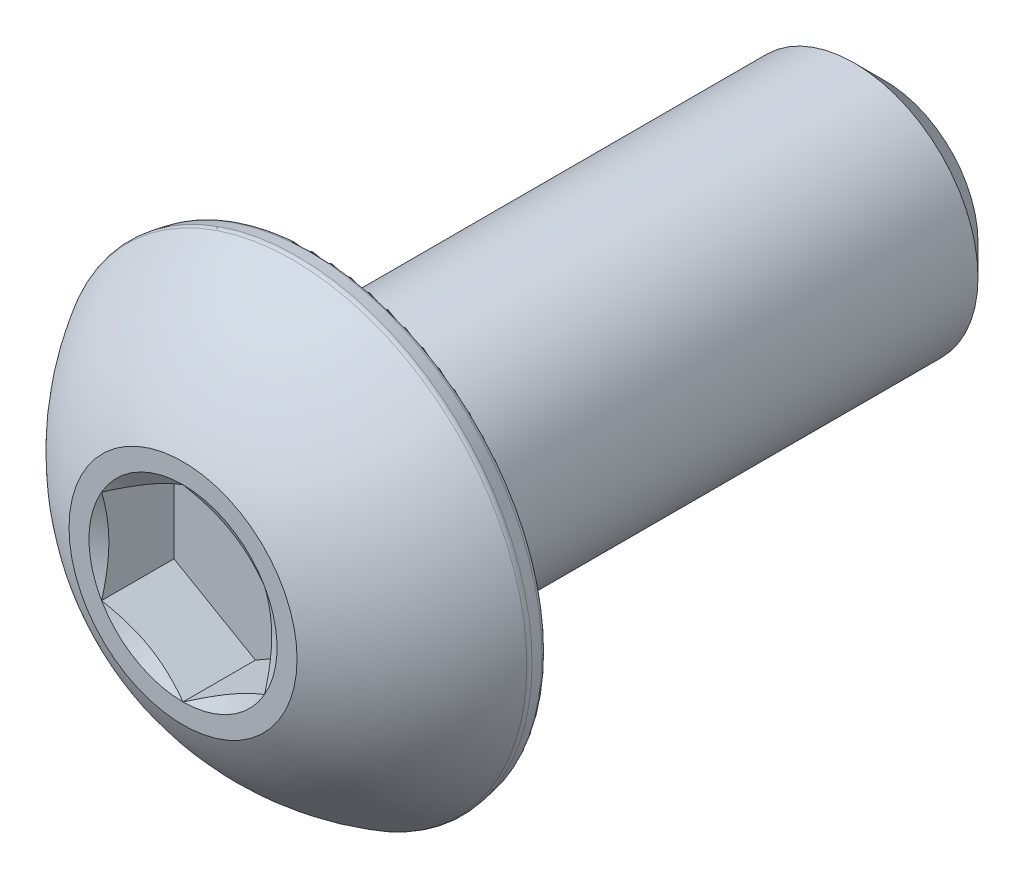
ISO-10303-21;
HEADER;
FILE_DESCRIPTION(('STEP AP214'),'2;1');
FILE_NAME('part.step','',(''),(''),'','','');
FILE_SCHEMA(('AUTOMOTIVE_DESIGN { 1 0 10303 214 1 1 1 1 }'));
ENDSEC;
DATA;
#1=APPLICATION_CONTEXT('core data for automotive mechanical design processes');
#2=APPLICATION_PROTOCOL_DEFINITION('international standard','automotive_design',2000,#1);
#3=PRODUCT_CONTEXT('',#1,'mechanical');
#4=PRODUCT('Part','Part','',(#3));
#5=PRODUCT_RELATED_PRODUCT_CATEGORY('part','',(#4));
#6=PRODUCT_DEFINITION_FORMATION('','',#4);
#7=PRODUCT_DEFINITION_CONTEXT('part definition',#1,'design');
#8=PRODUCT_DEFINITION('design','',#6,#7);
#9=PRODUCT_DEFINITION_SHAPE('','',#8);
#10=(LENGTH_UNIT() NAMED_UNIT(*) SI_UNIT(.MILLI.,.METRE.));
#11=(NAMED_UNIT(*) PLANE_ANGLE_UNIT() SI_UNIT($,.RADIAN.));
#12=(NAMED_UNIT(*) SI_UNIT($,.STERADIAN.) SOLID_ANGLE_UNIT());
#13=UNCERTAINTY_MEASURE_WITH_UNIT(LENGTH_MEASURE(1.E-05),#10,'distance_accuracy_value','');
#14=(GEOMETRIC_REPRESENTATION_CONTEXT(3) GLOBAL_UNCERTAINTY_ASSIGNED_CONTEXT((#13)) GLOBAL_UNIT_ASSIGNED_CONTEXT((#10,
#11,#12)) REPRESENTATION_CONTEXT('',''));
#15=CARTESIAN_POINT('',(0.,0.,0.));
#16=DIRECTION('',(0.,0.,1.));
#17=DIRECTION('',(1.,0.,0.));
#18=AXIS2_PLACEMENT_3D('',#15,#16,#17);
#19=CARTESIAN_POINT('',(0.,0.,6.83895));
#20=DIRECTION('',(0.,0.,-1.));
#21=DIRECTION('',(-1.,0.,0.));
#22=AXIS2_PLACEMENT_3D('',#19,#20,#21);
#23=PLANE('',#22);
#24=CARTESIAN_POINT('',(0.,0.,6.83895));
#25=DIRECTION('',(0.,0.,1.));
#26=DIRECTION('',(1.,0.,0.));
#27=AXIS2_PLACEMENT_3D('',#24,#25,#26);
#28=CIRCLE('',#27,1.83308710467706);
#29=CARTESIAN_POINT('',(-1.5875,0.916543552338531,6.83895));
#30=VERTEX_POINT('',#29);
#31=CARTESIAN_POINT('',(-1.5875,-0.916543552338531,6.83895));
#32=VERTEX_POINT('',#31);
#33=EDGE_CURVE('E95',#30,#32,#28,.T.);
#34=ORIENTED_EDGE('',*,*,#33,.F.);
#35=CARTESIAN_POINT('',(0.,1.83308710467706,6.83895));
#36=VERTEX_POINT('',#35);
#37=EDGE_CURVE('E104',#36,#30,#28,.T.);
#38=ORIENTED_EDGE('',*,*,#37,.F.);
#39=CARTESIAN_POINT('',(1.5875,0.916543552338532,6.83895));
#40=VERTEX_POINT('',#39);
#41=EDGE_CURVE('E55',#40,#36,#28,.T.);
#42=ORIENTED_EDGE('',*,*,#41,.F.);
#43=CARTESIAN_POINT('',(1.5875,-0.91654355233853,6.83895));
#44=VERTEX_POINT('',#43);
#45=EDGE_CURVE('E62',#44,#40,#28,.T.);
#46=ORIENTED_EDGE('',*,*,#45,.F.);
#47=CARTESIAN_POINT('',(0.,-1.83308710467706,6.83895));
#48=VERTEX_POINT('',#47);
#49=EDGE_CURVE('E137',#48,#44,#28,.T.);
#50=ORIENTED_EDGE('',*,*,#49,.F.);
#51=EDGE_CURVE('E105',#32,#48,#28,.T.);
#52=ORIENTED_EDGE('',*,*,#51,.F.);
#53=EDGE_LOOP('',(#34,#38,#42,#46,#50,#52));
#54=FACE_BOUND('',#53,.T.);
#55=CARTESIAN_POINT('',(0.,0.,6.83895));
#56=DIRECTION('',(0.,0.,1.));
#57=DIRECTION('',(1.,0.,0.));
#58=AXIS2_PLACEMENT_3D('',#55,#56,#57);
#59=CIRCLE('',#58,2.2225);
#60=CARTESIAN_POINT('',(2.2225,0.,6.83895));
#61=VERTEX_POINT('',#60);
#62=EDGE_CURVE('E116',#61,#61,#59,.T.);
#63=ORIENTED_EDGE('',*,*,#62,.T.);
#64=EDGE_LOOP('',(#63));
#65=FACE_BOUND('',#64,.T.);
#66=ADVANCED_FACE('F41',(#54,#65),#23,.F.);
#67=CARTESIAN_POINT('',(0.,0.,2.06158685789167));
#68=DIRECTION('',(0.,0.,1.));
#69=DIRECTION('',(0.,1.,0.));
#70=AXIS2_PLACEMENT_3D('',#67,#68,#69);
#71=SPHERICAL_SURFACE('',#70,5.26903262863072);
#72=CARTESIAN_POINT('',(0.,0.,4.69913865455147));
#73=DIRECTION('',(0.,0.,-1.));
#74=DIRECTION('',(-1.,0.,0.));
#75=AXIS2_PLACEMENT_3D('',#72,#73,#74);
#76=CIRCLE('',#75,4.56136222651872);
#77=CARTESIAN_POINT('',(-4.56136222651872,0.,4.69913865455147));
#78=VERTEX_POINT('',#77);
#79=EDGE_CURVE('E115',#78,#78,#76,.F.);
#80=ORIENTED_EDGE('',*,*,#79,.T.);
#81=EDGE_LOOP('',(#80));
#82=FACE_BOUND('',#81,.T.);
#83=ORIENTED_EDGE('',*,*,#62,.F.);
#84=EDGE_LOOP('',(#83));
#85=FACE_BOUND('',#84,.T.);
#86=ADVANCED_FACE('F210',(#82,#85),#71,.T.);
#87=CARTESIAN_POINT('',(0.,0.,4.27355));
#88=DIRECTION('',(0.,0.,1.));
#89=DIRECTION('',(1.,0.,0.));
#90=AXIS2_PLACEMENT_3D('',#87,#88,#89);
#91=CONICAL_SURFACE('',#90,4.51684761455358,0.174532925199434);
#92=CARTESIAN_POINT('',(0.,0.,4.61265590663413));
#93=DIRECTION('',(0.,0.,-1.));
#94=DIRECTION('',(-1.,0.,0.));
#95=AXIS2_PLACEMENT_3D('',#92,#93,#94);
#96=CIRCLE('',#95,4.57664113521078);
#97=CARTESIAN_POINT('',(-4.57664113521078,0.,4.61265590663413));
#98=VERTEX_POINT('',#97);
#99=EDGE_CURVE('E49',#98,#98,#96,.T.);
#100=ORIENTED_EDGE('',*,*,#99,.T.);
#101=EDGE_LOOP('',(#100));
#102=FACE_BOUND('',#101,.T.);
#103=CARTESIAN_POINT('',(0.,0.,4.37954614825066));
#104=DIRECTION('',(0.,0.,-1.));
#105=DIRECTION('',(-1.,0.,0.));
#106=AXIS2_PLACEMENT_3D('',#103,#104,#105);
#107=CIRCLE('',#106,4.53553759534134);
#108=CARTESIAN_POINT('',(-4.53553759534134,0.,4.37954614825066));
#109=VERTEX_POINT('',#108);
#110=EDGE_CURVE('E235',#109,#109,#107,.F.);
#111=ORIENTED_EDGE('',*,*,#110,.T.);
#112=EDGE_LOOP('',(#111));
#113=FACE_BOUND('',#112,.T.);
#114=ADVANCED_FACE('F217',(#102,#113),#91,.T.);
#115=CARTESIAN_POINT('',(0.,4.51684761455358,4.27355));
#116=DIRECTION('',(0.,0.,1.));
#117=DIRECTION('',(1.,0.,0.));
#118=AXIS2_PLACEMENT_3D('',#115,#116,#117);
#119=PLANE('',#118);
#120=CARTESIAN_POINT('',(0.,0.,4.27355));
#121=DIRECTION('',(0.,0.,1.));
#122=DIRECTION('',(1.,0.,0.));
#123=AXIS2_PLACEMENT_3D('',#120,#121,#122);
#124=CIRCLE('',#123,4.40921630486247);
#125=CARTESIAN_POINT('',(4.40921630486247,0.,4.27355));
#126=VERTEX_POINT('',#125);
#127=EDGE_CURVE('E11',#126,#126,#124,.F.);
#128=ORIENTED_EDGE('',*,*,#127,.T.);
#129=EDGE_LOOP('',(#128));
#130=FACE_BOUND('',#129,.T.);
#131=CARTESIAN_POINT('',(0.,0.,4.27355));
#132=DIRECTION('',(0.,0.,1.));
#133=DIRECTION('',(1.,0.,0.));
#134=AXIS2_PLACEMENT_3D('',#131,#132,#133);
#135=CIRCLE('',#134,2.413);
#136=CARTESIAN_POINT('',(2.413,0.,4.27355));
#137=VERTEX_POINT('',#136);
#138=EDGE_CURVE('E298',#137,#137,#135,.T.);
#139=ORIENTED_EDGE('',*,*,#138,.T.);
#140=EDGE_LOOP('',(#139));
#141=FACE_BOUND('',#140,.T.);
#142=ADVANCED_FACE('F241',(#130,#141),#119,.F.);
#143=CARTESIAN_POINT('',(0.,0.,6.83895));
#144=DIRECTION('',(0.,0.,1.));
#145=DIRECTION('',(1.,0.,0.));
#146=AXIS2_PLACEMENT_3D('',#143,#144,#145);
#147=CYLINDRICAL_SURFACE('',#146,2.413);
#148=ORIENTED_EDGE('',*,*,#138,.F.);
#149=EDGE_LOOP('',(#148));
#150=FACE_BOUND('',#149,.T.);
#151=CARTESIAN_POINT('',(0.,0.,-6.24363749999999));
#152=DIRECTION('',(0.,0.,1.));
#153=DIRECTION('',(1.,0.,0.));
#154=AXIS2_PLACEMENT_3D('',#151,#152,#153);
#155=CIRCLE('',#154,2.413);
#156=CARTESIAN_POINT('',(2.413,0.,-6.24363749999999));
#157=VERTEX_POINT('',#156);
#158=EDGE_CURVE('E295',#157,#157,#155,.T.);
#159=ORIENTED_EDGE('',*,*,#158,.T.);
#160=EDGE_LOOP('',(#159));
#161=FACE_BOUND('',#160,.T.);
#162=ADVANCED_FACE('F246',(#150,#161),#147,.T.);
#163=CARTESIAN_POINT('',(0.,0.,-6.83895));
#164=DIRECTION('',(0.,0.,1.));
#165=DIRECTION('',(1.,0.,0.));
#166=AXIS2_PLACEMENT_3D('',#163,#164,#165);
#167=CONICAL_SURFACE('',#166,1.8176875,0.785398163397444);
#168=ORIENTED_EDGE('',*,*,#158,.F.);
#169=EDGE_LOOP('',(#168));
#170=FACE_BOUND('',#169,.T.);
#171=CARTESIAN_POINT('',(0.,0.,-6.83895));
#172=DIRECTION('',(0.,0.,1.));
#173=DIRECTION('',(1.,0.,0.));
#174=AXIS2_PLACEMENT_3D('',#171,#172,#173);
#175=CIRCLE('',#174,1.8176875);
#176=CARTESIAN_POINT('',(1.8176875,0.,-6.83895));
#177=VERTEX_POINT('',#176);
#178=EDGE_CURVE('E283',#177,#177,#175,.T.);
#179=ORIENTED_EDGE('',*,*,#178,.T.);
#180=EDGE_LOOP('',(#179));
#181=FACE_BOUND('',#180,.T.);
#182=ADVANCED_FACE('F252',(#170,#181),#167,.T.);
#183=CARTESIAN_POINT('',(0.,0.,-6.83895));
#184=DIRECTION('',(0.,0.,1.));
#185=DIRECTION('',(1.,0.,0.));
#186=AXIS2_PLACEMENT_3D('',#183,#184,#185);
#187=PLANE('',#186);
#188=ORIENTED_EDGE('',*,*,#178,.F.);
#189=EDGE_LOOP('',(#188));
#190=FACE_BOUND('',#189,.T.);
#191=ADVANCED_FACE('F256',(#190),#187,.F.);
#192=CARTESIAN_POINT('',(0.,0.,6.83895));
#193=DIRECTION('',(0.,0.,1.));
#194=DIRECTION('',(1.,0.,0.));
#195=AXIS2_PLACEMENT_3D('',#192,#193,#194);
#196=CONICAL_SURFACE('',#195,1.83308710467706,1.0471975511966);
#197=ORIENTED_EDGE('',*,*,#51,.T.);
#198=CARTESIAN_POINT('',(-1.5877,-0.916428082284693,6.83901667296548));
#199=CARTESIAN_POINT('',(-1.51793561383713,-0.956706569415676,6.8157507862806));
#200=CARTESIAN_POINT('',(-1.44756902994941,-0.997332735565202,6.79459084371131));
#201=CARTESIAN_POINT('',(-1.30561723674211,-1.07928864158539,6.75765488003136));
#202=CARTESIAN_POINT('',(-1.23402950399672,-1.12061983835662,6.74189192735861));
#203=CARTESIAN_POINT('',(-1.09174129077364,-1.20276997656347,6.7173531289101));
#204=CARTESIAN_POINT('',(-1.02106271077293,-1.24357627375282,6.70841398931757));
#205=CARTESIAN_POINT('',(-0.87937276149872,-1.32538100410775,6.69773997802977));
#206=CARTESIAN_POINT('',(-0.808361907681014,-1.36637913967479,6.6959962700179));
#207=CARTESIAN_POINT('',(-0.675659384402059,-1.44299497721204,6.69961202281142));
#208=CARTESIAN_POINT('',(-0.6139479110751,-1.47862411294944,6.70408369010886));
#209=CARTESIAN_POINT('',(-0.49092703935686,-1.54965024635191,6.71825990710371));
#210=CARTESIAN_POINT('',(-0.429618066887652,-1.58504699811075,6.72796930554132));
#211=CARTESIAN_POINT('',(-0.306343280023913,-1.65621972949082,6.7522434889126));
#212=CARTESIAN_POINT('',(-0.244393078468155,-1.69198669503539,6.76691123370721));
#213=CARTESIAN_POINT('',(-0.121416971719016,-1.7629869833709,6.80020179834348));
#214=CARTESIAN_POINT('',(-0.0603894894127829,-1.79822121670837,6.81881678939009));
#215=CARTESIAN_POINT('',(0.000200000000000363,-1.8332025747309,6.83901667296548));
#216=B_SPLINE_CURVE_WITH_KNOTS('',3,(#198,#199,#200,#201,#202,#203,#204,#205,#206,#207,#208,
#209,#210,#211,#212,#213,#214,#215),.UNSPECIFIED.,.F.,.F.,(4,2,2,2,2,2,2,2,4),(0.,
0.251647272601204,0.503899652171032,0.749908024753695,0.995614197816256,1.20960574360963,
1.42379572923035,1.64273857632785,1.86125117688),.UNSPECIFIED.);
#217=EDGE_CURVE('E110',#32,#48,#216,.T.);
#218=ORIENTED_EDGE('',*,*,#217,.F.);
#219=EDGE_LOOP('',(#197,#218));
#220=FACE_BOUND('',#219,.T.);
#221=ADVANCED_FACE('F111',(#220),#196,.F.);
#222=ORIENTED_EDGE('',*,*,#49,.T.);
#223=CARTESIAN_POINT('',(-0.000199999999999405,-1.8332025747309,6.83901667296548));
#224=CARTESIAN_POINT('',(0.0695643861628727,-1.79292408759992,6.8157507862806));
#225=CARTESIAN_POINT('',(0.139930970050586,-1.75229792145039,6.79459084371131));
#226=CARTESIAN_POINT('',(0.281882763257893,-1.6703420154302,6.75765488003136));
#227=CARTESIAN_POINT('',(0.353470496003283,-1.62901081865898,6.74189192735861));
#228=CARTESIAN_POINT('',(0.49575870922636,-1.54686068045212,6.7173531289101));
#229=CARTESIAN_POINT('',(0.56643728922707,-1.50605438326277,6.70841398931757));
#230=CARTESIAN_POINT('',(0.70812723850128,-1.42424965290784,6.69773997802977));
#231=CARTESIAN_POINT('',(0.779138092318986,-1.3832515173408,6.6959962700179));
#232=CARTESIAN_POINT('',(0.911840615597942,-1.30663567980356,6.69961202281142));
#233=CARTESIAN_POINT('',(0.9735520889249,-1.27100654406615,6.70408369010886));
#234=CARTESIAN_POINT('',(1.09657296064314,-1.19998041066368,6.71825990710371));
#235=CARTESIAN_POINT('',(1.15788193311235,-1.16458365890484,6.72796930554132));
#236=CARTESIAN_POINT('',(1.28115671997609,-1.09341092752477,6.7522434889126));
#237=CARTESIAN_POINT('',(1.34310692153184,-1.0576439619802,6.76691123370721));
#238=CARTESIAN_POINT('',(1.46608302828098,-0.986643673644694,6.80020179834348));
#239=CARTESIAN_POINT('',(1.52711051058722,-0.951409440307225,6.81881678939009));
#240=CARTESIAN_POINT('',(1.5877,-0.916428082284693,6.83901667296548));
#241=B_SPLINE_CURVE_WITH_KNOTS('',3,(#223,#224,#225,#226,#227,#228,#229,#230,#231,#232,#233,
#234,#235,#236,#237,#238,#239,#240),.UNSPECIFIED.,.F.,.F.,(4,2,2,2,2,2,2,2,4),(0.,
0.251647272601204,0.503899652171032,0.749908024753695,0.995614197816256,1.20960574360963,
1.42379572923035,1.64273857632785,1.86125117688),.UNSPECIFIED.);
#242=EDGE_CURVE('E139',#48,#44,#241,.T.);
#243=ORIENTED_EDGE('',*,*,#242,.F.);
#244=EDGE_LOOP('',(#222,#243));
#245=FACE_BOUND('',#244,.T.);
#246=ADVANCED_FACE('F324',(#245),#196,.F.);
#247=ORIENTED_EDGE('',*,*,#45,.T.);
#248=CARTESIAN_POINT('',(1.5875,-2.37354288027605,7.4292385208739));
#249=CARTESIAN_POINT('',(1.5875,-2.30498906897407,7.39634898494012));
#250=CARTESIAN_POINT('',(1.5875,-2.23626839223786,7.36380115002616));
#251=CARTESIAN_POINT('',(1.5875,-2.09840401641784,7.29958250631927));
#252=CARTESIAN_POINT('',(1.5875,-2.02926024390265,7.26791185536114));
#253=CARTESIAN_POINT('',(1.5875,-1.89006393379529,7.20546427433972));
#254=CARTESIAN_POINT('',(1.5875,-1.82000842787054,7.17469393099725));
#255=CARTESIAN_POINT('',(1.5875,-1.6793106951035,7.11453374032632));
#256=CARTESIAN_POINT('',(1.5875,-1.60866849899343,7.08514382121805));
#257=CARTESIAN_POINT('',(1.5875,-1.46481905678083,7.02736035940791));
#258=CARTESIAN_POINT('',(1.5875,-1.39159303106009,6.99901294635992));
#259=CARTESIAN_POINT('',(1.5875,-1.24427117679401,6.94468445621924));
#260=CARTESIAN_POINT('',(1.5875,-1.17017524056602,6.91870367564426));
#261=CARTESIAN_POINT('',(1.5875,-0.946703117236297,6.84540698206836));
#262=CARTESIAN_POINT('',(1.5875,-0.795733661821908,6.80256477310572));
#263=CARTESIAN_POINT('',(1.5875,-0.566258816268269,6.7528699166704));
#264=CARTESIAN_POINT('',(1.5875,-0.489336969230922,6.7387394569834));
#265=CARTESIAN_POINT('',(1.5875,-0.334627971891014,6.71630337237578));
#266=CARTESIAN_POINT('',(1.5875,-0.256840880424315,6.70799735382842));
#267=CARTESIAN_POINT('',(1.5875,-0.101768207486039,6.69797845192268));
#268=CARTESIAN_POINT('',(1.5875,-0.0244877840878069,6.69618776489765));
#269=CARTESIAN_POINT('',(1.5875,0.129945425556551,6.69914355861705));
#270=CARTESIAN_POINT('',(1.5875,0.207098203603201,6.70389044414429));
#271=CARTESIAN_POINT('',(1.5875,0.39746123117644,6.72325049566141));
#272=CARTESIAN_POINT('',(1.5875,0.510302581730162,6.74149178568133));
#273=CARTESIAN_POINT('',(1.5875,0.73379094829414,6.78853080938572));
#274=CARTESIAN_POINT('',(1.5875,0.844435149473762,6.81734126611763));
#275=CARTESIAN_POINT('',(1.5875,1.00991571828403,6.86655656656476));
#276=CARTESIAN_POINT('',(1.5875,1.06560747491338,6.88419114075268));
#277=CARTESIAN_POINT('',(1.5875,1.17641127317168,6.92109158822815));
#278=CARTESIAN_POINT('',(1.5875,1.23152365277664,6.94035644345908));
#279=CARTESIAN_POINT('',(1.5875,1.34124234685352,6.98023767066016));
#280=CARTESIAN_POINT('',(1.5875,1.39584875124712,7.00085379701296));
#281=CARTESIAN_POINT('',(1.5875,1.50463128017381,7.0432145699702));
#282=CARTESIAN_POINT('',(1.5875,1.55880733021518,7.06495940724256));
#283=CARTESIAN_POINT('',(1.5875,1.69709397430045,7.12185694848123));
#284=CARTESIAN_POINT('',(1.5875,1.78092805766898,7.15768097949698));
#285=CARTESIAN_POINT('',(1.5875,1.94783917261492,7.23105596773212));
#286=CARTESIAN_POINT('',(1.5875,2.03091614691811,7.26860705432267));
#287=CARTESIAN_POINT('',(1.5875,2.27926367299452,7.38324209065483));
#288=CARTESIAN_POINT('',(1.5875,2.44362308741275,7.46229606459347));
#289=CARTESIAN_POINT('',(1.5875,2.77093773989402,7.62371952259686));
#290=CARTESIAN_POINT('',(1.5875,2.93389100335284,7.70609296308095));
#291=CARTESIAN_POINT('',(1.5875,3.25868106672949,7.87295793046289));
#292=CARTESIAN_POINT('',(1.5875,3.42051800525884,7.95744918813148));
#293=CARTESIAN_POINT('',(1.5875,3.72818042196342,8.11984703230934));
#294=CARTESIAN_POINT('',(1.5875,3.87407539856249,8.19762241102382));
#295=CARTESIAN_POINT('',(1.5875,4.16539605096666,8.35405933862617));
#296=CARTESIAN_POINT('',(1.5875,4.31082170914626,8.43272092030889));
#297=CARTESIAN_POINT('',(1.5875,4.60094201771575,8.59050709578743));
#298=CARTESIAN_POINT('',(1.5875,4.74563758660809,8.66963000299539));
#299=CARTESIAN_POINT('',(1.5875,5.03473618489941,8.8283907922694));
#300=CARTESIAN_POINT('',(1.5875,5.1791392292114,8.9080286471689));
#301=CARTESIAN_POINT('',(1.5875,5.32343717609415,8.98785533452521));
#302=B_SPLINE_CURVE_WITH_KNOTS('',3,(#248,#249,#250,#251,#252,#253,#254,#255,#256,#257,#258,
#259,#260,#261,#262,#263,#264,#265,#266,#267,#268,#269,#270,#271,#272,#273,#274,#275,#276,#277,
#278,#279,#280,#281,#282,#283,#284,#285,#286,#287,#288,#289,#290,#291,#292,#293,#294,#295,#296,
#297,#298,#299,#300,#301),.UNSPECIFIED.,.F.,.F.,(4,2,2,2,2,2,2,2,2,2,2,2,2,2,2,2,2,2,2,2,2,2,2,
2,2,2,4),(0.,0.228108416316536,0.456257613800003,0.685790772408023,0.915311982421997,
1.15083308117179,1.38638364812083,1.85615598568852,2.09060484106677,2.3250378504203,
2.55666198604243,2.78830046363685,3.13051568227743,3.47314421494376,3.6483760219735,
3.82349919880257,3.99859063171139,4.17371173887894,4.44718606585054,4.72068091184658,
5.267760937063,5.81551351008619,6.36319679928459,6.85918646152392,7.35519453905288,
7.84994100628722,8.34466158226601),.UNSPECIFIED.);
#303=EDGE_CURVE('E148',#44,#40,#302,.T.);
#304=ORIENTED_EDGE('',*,*,#303,.F.);
#305=EDGE_LOOP('',(#247,#304));
#306=FACE_BOUND('',#305,.T.);
#307=ADVANCED_FACE('F320',(#306),#196,.F.);
#308=ORIENTED_EDGE('',*,*,#41,.T.);
#309=CARTESIAN_POINT('',(1.5877,0.916428082284694,6.83901667296548));
#310=CARTESIAN_POINT('',(1.51793561383713,0.956706569415677,6.81575078628061));
#311=CARTESIAN_POINT('',(1.44756902994941,0.997332735565203,6.79459084371131));
#312=CARTESIAN_POINT('',(1.30561723674211,1.07928864158539,6.75765488003136));
#313=CARTESIAN_POINT('',(1.23402950399672,1.12061983835662,6.74189192735861));
#314=CARTESIAN_POINT('',(1.09174129077364,1.20276997656347,6.7173531289101));
#315=CARTESIAN_POINT('',(1.02106271077293,1.24357627375282,6.70841398931757));
#316=CARTESIAN_POINT('',(0.87937276149872,1.32538100410775,6.69773997802977));
#317=CARTESIAN_POINT('',(0.808361907681014,1.36637913967479,6.6959962700179));
#318=CARTESIAN_POINT('',(0.675659384402059,1.44299497721204,6.69961202281142));
#319=CARTESIAN_POINT('',(0.6139479110751,1.47862411294945,6.70408369010886));
#320=CARTESIAN_POINT('',(0.490927039356861,1.54965024635191,6.71825990710371));
#321=CARTESIAN_POINT('',(0.429618066887652,1.58504699811075,6.72796930554133));
#322=CARTESIAN_POINT('',(0.306343280023913,1.65621972949082,6.7522434889126));
#323=CARTESIAN_POINT('',(0.244393078468155,1.69198669503539,6.76691123370721));
#324=CARTESIAN_POINT('',(0.121416971719016,1.7629869833709,6.80020179834348));
#325=CARTESIAN_POINT('',(0.0603894894127827,1.79822121670837,6.81881678939009));
#326=CARTESIAN_POINT('',(-0.000200000000000523,1.8332025747309,6.83901667296548));
#327=B_SPLINE_CURVE_WITH_KNOTS('',3,(#309,#310,#311,#312,#313,#314,#315,#316,#317,#318,#319,
#320,#321,#322,#323,#324,#325,#326),.UNSPECIFIED.,.F.,.F.,(4,2,2,2,2,2,2,2,4),(0.,
0.251647272601204,0.503899652171032,0.749908024753695,0.995614197816257,1.20960574360963,
1.42379572923035,1.64273857632785,1.86125117688),.UNSPECIFIED.);
#328=EDGE_CURVE('E175',#40,#36,#327,.T.);
#329=ORIENTED_EDGE('',*,*,#328,.F.);
#330=EDGE_LOOP('',(#308,#329));
#331=FACE_BOUND('',#330,.T.);
#332=ADVANCED_FACE('F316',(#331),#196,.F.);
#333=ORIENTED_EDGE('',*,*,#37,.T.);
#334=CARTESIAN_POINT('',(0.000199999999999306,1.8332025747309,6.83901667296548));
#335=CARTESIAN_POINT('',(-0.0695643861628729,1.79292408759992,6.81575078628061));
#336=CARTESIAN_POINT('',(-0.139930970050586,1.75229792145039,6.79459084371131));
#337=CARTESIAN_POINT('',(-0.281882763257893,1.6703420154302,6.75765488003136));
#338=CARTESIAN_POINT('',(-0.353470496003283,1.62901081865898,6.74189192735861));
#339=CARTESIAN_POINT('',(-0.49575870922636,1.54686068045212,6.7173531289101));
#340=CARTESIAN_POINT('',(-0.56643728922707,1.50605438326277,6.70841398931757));
#341=CARTESIAN_POINT('',(-0.70812723850128,1.42424965290784,6.69773997802977));
#342=CARTESIAN_POINT('',(-0.779138092318986,1.3832515173408,6.6959962700179));
#343=CARTESIAN_POINT('',(-0.911840615597942,1.30663567980356,6.69961202281142));
#344=CARTESIAN_POINT('',(-0.9735520889249,1.27100654406615,6.70408369010886));
#345=CARTESIAN_POINT('',(-1.09657296064314,1.19998041066368,6.71825990710371));
#346=CARTESIAN_POINT('',(-1.15788193311235,1.16458365890484,6.72796930554133));
#347=CARTESIAN_POINT('',(-1.28115671997609,1.09341092752477,6.7522434889126));
#348=CARTESIAN_POINT('',(-1.34310692153184,1.0576439619802,6.76691123370721));
#349=CARTESIAN_POINT('',(-1.46608302828098,0.986643673644694,6.80020179834348));
#350=CARTESIAN_POINT('',(-1.52711051058722,0.951409440307226,6.81881678939009));
#351=CARTESIAN_POINT('',(-1.5877,0.916428082284693,6.83901667296548));
#352=B_SPLINE_CURVE_WITH_KNOTS('',3,(#334,#335,#336,#337,#338,#339,#340,#341,#342,#343,#344,
#345,#346,#347,#348,#349,#350,#351),.UNSPECIFIED.,.F.,.F.,(4,2,2,2,2,2,2,2,4),(0.,
0.251647272601204,0.503899652171032,0.749908024753695,0.995614197816257,1.20960574360963,
1.42379572923035,1.64273857632785,1.86125117688),.UNSPECIFIED.);
#353=EDGE_CURVE('E126',#36,#30,#352,.T.);
#354=ORIENTED_EDGE('',*,*,#353,.F.);
#355=EDGE_LOOP('',(#333,#354));
#356=FACE_BOUND('',#355,.T.);
#357=ADVANCED_FACE('F162',(#356),#196,.F.);
#358=ORIENTED_EDGE('',*,*,#33,.T.);
#359=CARTESIAN_POINT('',(-1.5875,-2.37354288027605,7.4292385208739));
#360=CARTESIAN_POINT('',(-1.5875,-2.30498906897407,7.39634898494012));
#361=CARTESIAN_POINT('',(-1.5875,-2.23626839223786,7.36380115002616));
#362=CARTESIAN_POINT('',(-1.5875,-2.09840401641784,7.29958250631927));
#363=CARTESIAN_POINT('',(-1.5875,-2.02926024390265,7.26791185536114));
#364=CARTESIAN_POINT('',(-1.5875,-1.89006393379529,7.20546427433972));
#365=CARTESIAN_POINT('',(-1.5875,-1.82000842787054,7.17469393099725));
#366=CARTESIAN_POINT('',(-1.5875,-1.6793106951035,7.11453374032632));
#367=CARTESIAN_POINT('',(-1.5875,-1.60866849899343,7.08514382121805));
#368=CARTESIAN_POINT('',(-1.5875,-1.46481905678083,7.02736035940791));
#369=CARTESIAN_POINT('',(-1.5875,-1.39159303106009,6.99901294635992));
#370=CARTESIAN_POINT('',(-1.5875,-1.24427117679401,6.94468445621924));
#371=CARTESIAN_POINT('',(-1.5875,-1.17017524056603,6.91870367564426));
#372=CARTESIAN_POINT('',(-1.5875,-0.946703117236298,6.84540698206836));
#373=CARTESIAN_POINT('',(-1.5875,-0.795733661821908,6.80256477310572));
#374=CARTESIAN_POINT('',(-1.5875,-0.56625881626827,6.7528699166704));
#375=CARTESIAN_POINT('',(-1.5875,-0.489336969230923,6.7387394569834));
#376=CARTESIAN_POINT('',(-1.5875,-0.334627971891014,6.71630337237578));
#377=CARTESIAN_POINT('',(-1.5875,-0.256840880424316,6.70799735382842));
#378=CARTESIAN_POINT('',(-1.5875,-0.10176820748604,6.69797845192268));
#379=CARTESIAN_POINT('',(-1.5875,-0.0244877840878075,6.69618776489765));
#380=CARTESIAN_POINT('',(-1.5875,0.129945425556551,6.69914355861705));
#381=CARTESIAN_POINT('',(-1.5875,0.2070982036032,6.70389044414429));
#382=CARTESIAN_POINT('',(-1.5875,0.39746123117644,6.72325049566141));
#383=CARTESIAN_POINT('',(-1.5875,0.510302581730161,6.74149178568133));
#384=CARTESIAN_POINT('',(-1.5875,0.733790948294139,6.78853080938572));
#385=CARTESIAN_POINT('',(-1.5875,0.844435149473761,6.81734126611763));
#386=CARTESIAN_POINT('',(-1.5875,1.00991571828403,6.86655656656476));
#387=CARTESIAN_POINT('',(-1.5875,1.06560747491337,6.88419114075268));
#388=CARTESIAN_POINT('',(-1.5875,1.17641127317168,6.92109158822815));
#389=CARTESIAN_POINT('',(-1.5875,1.23152365277664,6.94035644345908));
#390=CARTESIAN_POINT('',(-1.5875,1.34124234685352,6.98023767066016));
#391=CARTESIAN_POINT('',(-1.5875,1.39584875124712,7.00085379701296));
#392=CARTESIAN_POINT('',(-1.5875,1.5046312801738,7.0432145699702));
#393=CARTESIAN_POINT('',(-1.5875,1.55880733021518,7.06495940724256));
#394=CARTESIAN_POINT('',(-1.5875,1.69709397430045,7.12185694848123));
#395=CARTESIAN_POINT('',(-1.5875,1.78092805766898,7.15768097949698));
#396=CARTESIAN_POINT('',(-1.5875,1.94783917261492,7.23105596773212));
#397=CARTESIAN_POINT('',(-1.5875,2.03091614691811,7.26860705432267));
#398=CARTESIAN_POINT('',(-1.5875,2.27926367299452,7.38324209065483));
#399=CARTESIAN_POINT('',(-1.5875,2.44362308741275,7.46229606459347));
#400=CARTESIAN_POINT('',(-1.5875,2.77093773989402,7.62371952259686));
#401=CARTESIAN_POINT('',(-1.5875,2.93389100335284,7.70609296308095));
#402=CARTESIAN_POINT('',(-1.5875,3.25868106672949,7.87295793046289));
#403=CARTESIAN_POINT('',(-1.5875,3.42051800525884,7.95744918813148));
#404=CARTESIAN_POINT('',(-1.5875,3.72818042196342,8.11984703230934));
#405=CARTESIAN_POINT('',(-1.5875,3.87407539856249,8.19762241102382));
#406=CARTESIAN_POINT('',(-1.5875,4.16539605096666,8.35405933862617));
#407=CARTESIAN_POINT('',(-1.5875,4.31082170914626,8.43272092030889));
#408=CARTESIAN_POINT('',(-1.5875,4.60094201771575,8.59050709578743));
#409=CARTESIAN_POINT('',(-1.5875,4.74563758660809,8.66963000299538));
#410=CARTESIAN_POINT('',(-1.5875,5.03473618489941,8.8283907922694));
#411=CARTESIAN_POINT('',(-1.5875,5.1791392292114,8.9080286471689));
#412=CARTESIAN_POINT('',(-1.5875,5.32343717609415,8.98785533452521));
#413=B_SPLINE_CURVE_WITH_KNOTS('',3,(#359,#360,#361,#362,#363,#364,#365,#366,#367,#368,#369,
#370,#371,#372,#373,#374,#375,#376,#377,#378,#379,#380,#381,#382,#383,#384,#385,#386,#387,#388,
#389,#390,#391,#392,#393,#394,#395,#396,#397,#398,#399,#400,#401,#402,#403,#404,#405,#406,#407,
#408,#409,#410,#411,#412),.UNSPECIFIED.,.F.,.F.,(4,2,2,2,2,2,2,2,2,2,2,2,2,2,2,2,2,2,2,2,2,2,2,
2,2,2,4),(0.,0.228108416316536,0.456257613800003,0.685790772408022,0.915311982421996,
1.15083308117179,1.38638364812082,1.85615598568851,2.09060484106677,2.3250378504203,
2.55666198604243,2.78830046363685,3.13051568227743,3.47314421494376,3.6483760219735,
3.82349919880256,3.99859063171139,4.17371173887894,4.44718606585054,4.72068091184658,
5.267760937063,5.81551351008619,6.36319679928459,6.85918646152392,7.35519453905289,
7.84994100628722,8.34466158226601),.UNSPECIFIED.);
#414=EDGE_CURVE('E99',#30,#32,#413,.F.);
#415=ORIENTED_EDGE('',*,*,#414,.F.);
#416=EDGE_LOOP('',(#358,#415));
#417=FACE_BOUND('',#416,.T.);
#418=ADVANCED_FACE('F97',(#417),#196,.F.);
#419=CARTESIAN_POINT('',(0.,0.,5.42798));
#420=DIRECTION('',(0.,0.,1.));
#421=DIRECTION('',(1.,0.,0.));
#422=AXIS2_PLACEMENT_3D('',#419,#420,#421);
#423=PLANE('',#422);
#424=DIRECTION('',(0.,-1.,0.));
#425=VECTOR('',#424,1.);
#426=CARTESIAN_POINT('',(-1.5875,0.916543552338531,5.42798));
#427=LINE('',#426,#425);
#428=CARTESIAN_POINT('',(-1.5875,0.916543552338531,5.42798));
#429=VERTEX_POINT('',#428);
#430=CARTESIAN_POINT('',(-1.5875,-0.916543552338531,5.42798));
#431=VERTEX_POINT('',#430);
#432=EDGE_CURVE('E125',#429,#431,#427,.T.);
#433=ORIENTED_EDGE('',*,*,#432,.T.);
#434=DIRECTION('',(0.866025403784439,-0.5,0.));
#435=VECTOR('',#434,1.);
#436=CARTESIAN_POINT('',(-1.5875,-0.916543552338531,5.42798));
#437=LINE('',#436,#435);
#438=CARTESIAN_POINT('',(0.,-1.83308710467706,5.42798));
#439=VERTEX_POINT('',#438);
#440=EDGE_CURVE('E130',#431,#439,#437,.T.);
#441=ORIENTED_EDGE('',*,*,#440,.T.);
#442=DIRECTION('',(0.866025403784438,0.5,0.));
#443=VECTOR('',#442,1.);
#444=CARTESIAN_POINT('',(0.,-1.83308710467706,5.42798));
#445=LINE('',#444,#443);
#446=CARTESIAN_POINT('',(1.5875,-0.91654355233853,5.42798));
#447=VERTEX_POINT('',#446);
#448=EDGE_CURVE('E272',#439,#447,#445,.T.);
#449=ORIENTED_EDGE('',*,*,#448,.T.);
#450=DIRECTION('',(0.,1.,0.));
#451=VECTOR('',#450,1.);
#452=CARTESIAN_POINT('',(1.5875,-0.91654355233853,5.42798));
#453=LINE('',#452,#451);
#454=CARTESIAN_POINT('',(1.5875,0.916543552338532,5.42798));
#455=VERTEX_POINT('',#454);
#456=EDGE_CURVE('E276',#447,#455,#453,.T.);
#457=ORIENTED_EDGE('',*,*,#456,.T.);
#458=DIRECTION('',(-0.866025403784439,0.5,0.));
#459=VECTOR('',#458,1.);
#460=CARTESIAN_POINT('',(1.5875,0.916543552338532,5.42798));
#461=LINE('',#460,#459);
#462=CARTESIAN_POINT('',(0.,1.83308710467706,5.42798));
#463=VERTEX_POINT('',#462);
#464=EDGE_CURVE('E279',#455,#463,#461,.T.);
#465=ORIENTED_EDGE('',*,*,#464,.T.);
#466=DIRECTION('',(-0.866025403784438,-0.5,0.));
#467=VECTOR('',#466,1.);
#468=CARTESIAN_POINT('',(0.,1.83308710467706,5.42798));
#469=LINE('',#468,#467);
#470=EDGE_CURVE('E133',#463,#429,#469,.T.);
#471=ORIENTED_EDGE('',*,*,#470,.T.);
#472=EDGE_LOOP('',(#433,#441,#449,#457,#465,#471));
#473=FACE_BOUND('',#472,.T.);
#474=ADVANCED_FACE('F161',(#473),#423,.T.);
#475=CARTESIAN_POINT('',(-1.5875,-0.916543552338531,5.42798));
#476=DIRECTION('',(-0.5,-0.866025403784439,0.));
#477=DIRECTION('',(0.866025403784439,-0.5,0.));
#478=AXIS2_PLACEMENT_3D('',#475,#476,#477);
#479=PLANE('',#478);
#480=DIRECTION('',(0.,0.,1.));
#481=VECTOR('',#480,1.);
#482=CARTESIAN_POINT('',(-1.5875,-0.916543552338531,5.42798));
#483=LINE('',#482,#481);
#484=EDGE_CURVE('E121',#431,#32,#483,.T.);
#485=ORIENTED_EDGE('',*,*,#484,.T.);
#486=ORIENTED_EDGE('',*,*,#217,.T.);
#487=DIRECTION('',(0.,0.,1.));
#488=VECTOR('',#487,1.);
#489=CARTESIAN_POINT('',(0.,-1.83308710467706,5.42798));
#490=LINE('',#489,#488);
#491=EDGE_CURVE('E132',#439,#48,#490,.T.);
#492=ORIENTED_EDGE('',*,*,#491,.F.);
#493=ORIENTED_EDGE('',*,*,#440,.F.);
#494=EDGE_LOOP('',(#485,#486,#492,#493));
#495=FACE_BOUND('',#494,.T.);
#496=ADVANCED_FACE('F128',(#495),#479,.F.);
#497=CARTESIAN_POINT('',(0.,-1.83308710467706,5.42798));
#498=DIRECTION('',(0.5,-0.866025403784438,0.));
#499=DIRECTION('',(0.866025403784439,0.5,0.));
#500=AXIS2_PLACEMENT_3D('',#497,#498,#499);
#501=PLANE('',#500);
#502=ORIENTED_EDGE('',*,*,#491,.T.);
#503=ORIENTED_EDGE('',*,*,#242,.T.);
#504=DIRECTION('',(0.,0.,1.));
#505=VECTOR('',#504,1.);
#506=CARTESIAN_POINT('',(1.5875,-0.91654355233853,5.42798));
#507=LINE('',#506,#505);
#508=EDGE_CURVE('E290',#447,#44,#507,.T.);
#509=ORIENTED_EDGE('',*,*,#508,.F.);
#510=ORIENTED_EDGE('',*,*,#448,.F.);
#511=EDGE_LOOP('',(#502,#503,#509,#510));
#512=FACE_BOUND('',#511,.T.);
#513=ADVANCED_FACE('F155',(#512),#501,.F.);
#514=CARTESIAN_POINT('',(1.5875,-0.91654355233853,5.42798));
#515=DIRECTION('',(1.,0.,0.));
#516=DIRECTION('',(0.,1.,0.));
#517=AXIS2_PLACEMENT_3D('',#514,#515,#516);
#518=PLANE('',#517);
#519=ORIENTED_EDGE('',*,*,#508,.T.);
#520=ORIENTED_EDGE('',*,*,#303,.T.);
#521=DIRECTION('',(0.,0.,1.));
#522=VECTOR('',#521,1.);
#523=CARTESIAN_POINT('',(1.5875,0.916543552338532,5.42798));
#524=LINE('',#523,#522);
#525=EDGE_CURVE('E287',#455,#40,#524,.T.);
#526=ORIENTED_EDGE('',*,*,#525,.F.);
#527=ORIENTED_EDGE('',*,*,#456,.F.);
#528=EDGE_LOOP('',(#519,#520,#526,#527));
#529=FACE_BOUND('',#528,.T.);
#530=ADVANCED_FACE('F199',(#529),#518,.F.);
#531=CARTESIAN_POINT('',(1.5875,0.916543552338532,5.42798));
#532=DIRECTION('',(0.5,0.866025403784439,0.));
#533=DIRECTION('',(-0.866025403784439,0.5,0.));
#534=AXIS2_PLACEMENT_3D('',#531,#532,#533);
#535=PLANE('',#534);
#536=ORIENTED_EDGE('',*,*,#525,.T.);
#537=ORIENTED_EDGE('',*,*,#328,.T.);
#538=DIRECTION('',(0.,0.,1.));
#539=VECTOR('',#538,1.);
#540=CARTESIAN_POINT('',(0.,1.83308710467706,5.42798));
#541=LINE('',#540,#539);
#542=EDGE_CURVE('E284',#463,#36,#541,.T.);
#543=ORIENTED_EDGE('',*,*,#542,.F.);
#544=ORIENTED_EDGE('',*,*,#464,.F.);
#545=EDGE_LOOP('',(#536,#537,#543,#544));
#546=FACE_BOUND('',#545,.T.);
#547=ADVANCED_FACE('F195',(#546),#535,.F.);
#548=CARTESIAN_POINT('',(0.,1.83308710467706,5.42798));
#549=DIRECTION('',(-0.5,0.866025403784438,0.));
#550=DIRECTION('',(-0.866025403784439,-0.5,0.));
#551=AXIS2_PLACEMENT_3D('',#548,#549,#550);
#552=PLANE('',#551);
#553=ORIENTED_EDGE('',*,*,#542,.T.);
#554=ORIENTED_EDGE('',*,*,#353,.T.);
#555=DIRECTION('',(0.,0.,1.));
#556=VECTOR('',#555,1.);
#557=CARTESIAN_POINT('',(-1.5875,0.916543552338531,5.42798));
#558=LINE('',#557,#556);
#559=EDGE_CURVE('E123',#429,#30,#558,.T.);
#560=ORIENTED_EDGE('',*,*,#559,.F.);
#561=ORIENTED_EDGE('',*,*,#470,.F.);
#562=EDGE_LOOP('',(#553,#554,#560,#561));
#563=FACE_BOUND('',#562,.T.);
#564=ADVANCED_FACE('F192',(#563),#552,.F.);
#565=CARTESIAN_POINT('',(-1.5875,0.916543552338531,5.42798));
#566=DIRECTION('',(-1.,0.,0.));
#567=DIRECTION('',(0.,0.,1.));
#568=AXIS2_PLACEMENT_3D('',#565,#566,#567);
#569=PLANE('',#568);
#570=ORIENTED_EDGE('',*,*,#559,.T.);
#571=ORIENTED_EDGE('',*,*,#414,.T.);
#572=ORIENTED_EDGE('',*,*,#484,.F.);
#573=ORIENTED_EDGE('',*,*,#432,.F.);
#574=EDGE_LOOP('',(#570,#571,#572,#573));
#575=FACE_BOUND('',#574,.T.);
#576=ADVANCED_FACE('F119',(#575),#569,.F.);
#577=CARTESIAN_POINT('',(0.,0.,4.63492975838346));
#578=DIRECTION('',(0.,0.,-1.));
#579=DIRECTION('',(-1.,0.,0.));
#580=AXIS2_PLACEMENT_3D('',#577,#578,#579);
#581=TOROIDAL_SURFACE('',#580,4.4503198447319,0.12827);
#582=ORIENTED_EDGE('',*,*,#99,.F.);
#583=EDGE_LOOP('',(#582));
#584=FACE_BOUND('',#583,.T.);
#585=ORIENTED_EDGE('',*,*,#79,.F.);
#586=EDGE_LOOP('',(#585));
#587=FACE_BOUND('',#586,.T.);
#588=ADVANCED_FACE('F221',(#584,#587),#581,.T.);
#589=CARTESIAN_POINT('',(0.,0.,4.40182));
#590=DIRECTION('',(0.,0.,1.));
#591=DIRECTION('',(1.,0.,0.));
#592=AXIS2_PLACEMENT_3D('',#589,#590,#591);
#593=TOROIDAL_SURFACE('',#592,4.40921630486247,0.12827);
#594=ORIENTED_EDGE('',*,*,#127,.F.);
#595=EDGE_LOOP('',(#594));
#596=FACE_BOUND('',#595,.T.);
#597=ORIENTED_EDGE('',*,*,#110,.F.);
#598=EDGE_LOOP('',(#597));
#599=FACE_BOUND('',#598,.T.);
#600=ADVANCED_FACE('F43',(#596,#599),#593,.T.);
#601=CLOSED_SHELL('',(#66,#86,#114,#142,#162,#182,#191,#221,#246,#307,#332,#357,#418,#474,#496,
#513,#530,#547,#564,#576,#588,#600));
#602=MANIFOLD_SOLID_BREP('B2',#601);
#603=ADVANCED_BREP_SHAPE_REPRESENTATION('',(#18,#602),#14);
#604=SHAPE_DEFINITION_REPRESENTATION(#9,#603);
ENDSEC;
END-ISO-10303-21;
